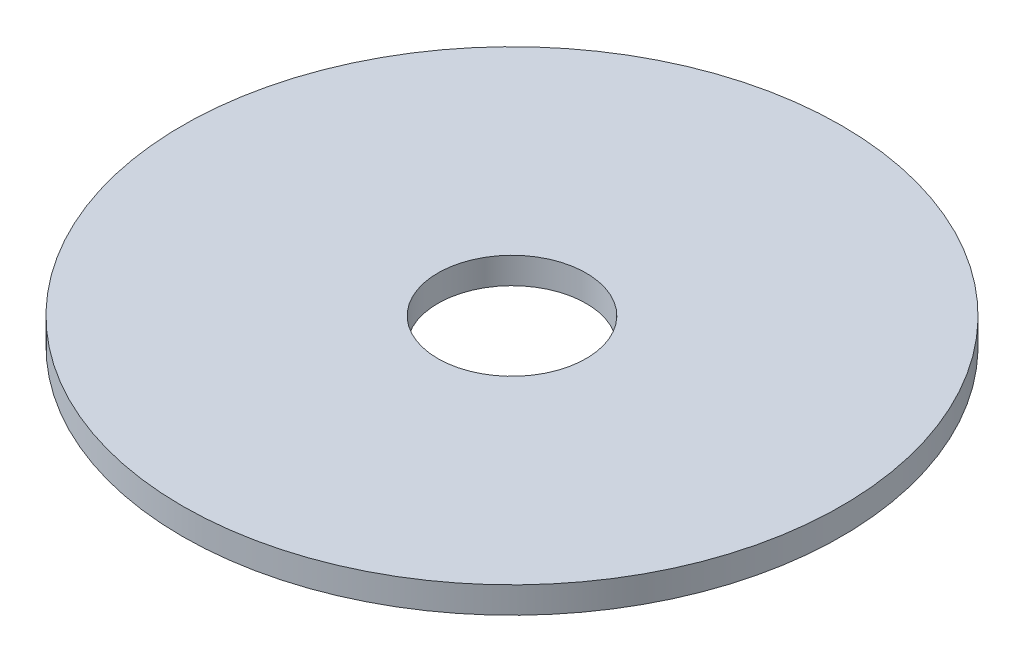
ISO-10303-21;
HEADER;
FILE_DESCRIPTION(('STEP AP214'),'2;1');
FILE_NAME('part.step','',(''),(''),'','','');
FILE_SCHEMA(('AUTOMOTIVE_DESIGN { 1 0 10303 214 1 1 1 1 }'));
ENDSEC;
DATA;
#1=APPLICATION_CONTEXT('core data for automotive mechanical design processes');
#2=APPLICATION_PROTOCOL_DEFINITION('international standard','automotive_design',2000,#1);
#3=PRODUCT_CONTEXT('',#1,'mechanical');
#4=PRODUCT('Part','Part','',(#3));
#5=PRODUCT_RELATED_PRODUCT_CATEGORY('part','',(#4));
#6=PRODUCT_DEFINITION_FORMATION('','',#4);
#7=PRODUCT_DEFINITION_CONTEXT('part definition',#1,'design');
#8=PRODUCT_DEFINITION('design','',#6,#7);
#9=PRODUCT_DEFINITION_SHAPE('','',#8);
#10=(LENGTH_UNIT() NAMED_UNIT(*) SI_UNIT(.MILLI.,.METRE.));
#11=(NAMED_UNIT(*) PLANE_ANGLE_UNIT() SI_UNIT($,.RADIAN.));
#12=(NAMED_UNIT(*) SI_UNIT($,.STERADIAN.) SOLID_ANGLE_UNIT());
#13=UNCERTAINTY_MEASURE_WITH_UNIT(LENGTH_MEASURE(1.E-05),#10,'distance_accuracy_value','');
#14=(GEOMETRIC_REPRESENTATION_CONTEXT(3) GLOBAL_UNCERTAINTY_ASSIGNED_CONTEXT((#13)) GLOBAL_UNIT_ASSIGNED_CONTEXT((#10,
#11,#12)) REPRESENTATION_CONTEXT('',''));
#15=CARTESIAN_POINT('',(0.,0.,0.));
#16=DIRECTION('',(0.,0.,1.));
#17=DIRECTION('',(1.,0.,0.));
#18=AXIS2_PLACEMENT_3D('',#15,#16,#17);
#19=CARTESIAN_POINT('',(0.,8.,0.));
#20=DIRECTION('',(0.,-1.,0.));
#21=DIRECTION('',(0.,0.,-1.));
#22=AXIS2_PLACEMENT_3D('',#19,#20,#21);
#23=CYLINDRICAL_SURFACE('',#22,100.);
#24=CARTESIAN_POINT('',(0.,8.,0.));
#25=DIRECTION('',(0.,1.,0.));
#26=DIRECTION('',(0.,0.,1.));
#27=AXIS2_PLACEMENT_3D('',#24,#25,#26);
#28=CIRCLE('',#27,100.);
#29=CARTESIAN_POINT('',(0.,8.,100.));
#30=VERTEX_POINT('',#29);
#31=EDGE_CURVE('E10',#30,#30,#28,.T.);
#32=ORIENTED_EDGE('',*,*,#31,.F.);
#33=EDGE_LOOP('',(#32));
#34=FACE_BOUND('',#33,.T.);
#35=CARTESIAN_POINT('',(0.,0.,0.));
#36=DIRECTION('',(0.,1.,0.));
#37=DIRECTION('',(0.,0.,1.));
#38=AXIS2_PLACEMENT_3D('',#35,#36,#37);
#39=CIRCLE('',#38,100.);
#40=CARTESIAN_POINT('',(0.,0.,100.));
#41=VERTEX_POINT('',#40);
#42=EDGE_CURVE('E37',#41,#41,#39,.T.);
#43=ORIENTED_EDGE('',*,*,#42,.T.);
#44=EDGE_LOOP('',(#43));
#45=FACE_BOUND('',#44,.T.);
#46=ADVANCED_FACE('F40',(#34,#45),#23,.T.);
#47=CARTESIAN_POINT('',(0.,8.,0.));
#48=DIRECTION('',(0.,1.,0.));
#49=DIRECTION('',(0.,0.,1.));
#50=AXIS2_PLACEMENT_3D('',#47,#48,#49);
#51=PLANE('',#50);
#52=CARTESIAN_POINT('',(0.,8.,0.));
#53=DIRECTION('',(0.,1.,0.));
#54=DIRECTION('',(0.,0.,1.));
#55=AXIS2_PLACEMENT_3D('',#52,#53,#54);
#56=CIRCLE('',#55,22.5);
#57=CARTESIAN_POINT('',(0.,8.,22.5));
#58=VERTEX_POINT('',#57);
#59=EDGE_CURVE('E50',#58,#58,#56,.T.);
#60=ORIENTED_EDGE('',*,*,#59,.F.);
#61=EDGE_LOOP('',(#60));
#62=FACE_BOUND('',#61,.T.);
#63=ORIENTED_EDGE('',*,*,#31,.T.);
#64=EDGE_LOOP('',(#63));
#65=FACE_BOUND('',#64,.T.);
#66=ADVANCED_FACE('F59',(#62,#65),#51,.T.);
#67=CARTESIAN_POINT('',(0.,0.,0.));
#68=DIRECTION('',(0.,1.,0.));
#69=DIRECTION('',(0.,0.,1.));
#70=AXIS2_PLACEMENT_3D('',#67,#68,#69);
#71=PLANE('',#70);
#72=CARTESIAN_POINT('',(0.,0.,0.));
#73=DIRECTION('',(0.,1.,0.));
#74=DIRECTION('',(0.,0.,1.));
#75=AXIS2_PLACEMENT_3D('',#72,#73,#74);
#76=CIRCLE('',#75,22.5);
#77=CARTESIAN_POINT('',(0.,0.,22.5));
#78=VERTEX_POINT('',#77);
#79=EDGE_CURVE('E47',#78,#78,#76,.T.);
#80=ORIENTED_EDGE('',*,*,#79,.T.);
#81=EDGE_LOOP('',(#80));
#82=FACE_BOUND('',#81,.T.);
#83=ORIENTED_EDGE('',*,*,#42,.F.);
#84=EDGE_LOOP('',(#83));
#85=FACE_BOUND('',#84,.T.);
#86=ADVANCED_FACE('F58',(#82,#85),#71,.F.);
#87=CARTESIAN_POINT('',(0.,8.,0.));
#88=DIRECTION('',(0.,-1.,0.));
#89=DIRECTION('',(0.,0.,-1.));
#90=AXIS2_PLACEMENT_3D('',#87,#88,#89);
#91=CYLINDRICAL_SURFACE('',#90,22.5);
#92=ORIENTED_EDGE('',*,*,#59,.T.);
#93=EDGE_LOOP('',(#92));
#94=FACE_BOUND('',#93,.T.);
#95=ORIENTED_EDGE('',*,*,#79,.F.);
#96=EDGE_LOOP('',(#95));
#97=FACE_BOUND('',#96,.T.);
#98=ADVANCED_FACE('F54',(#94,#97),#91,.F.);
#99=CLOSED_SHELL('',(#46,#66,#86,#98));
#100=MANIFOLD_SOLID_BREP('B2',#99);
#101=ADVANCED_BREP_SHAPE_REPRESENTATION('',(#18,#100),#14);
#102=SHAPE_DEFINITION_REPRESENTATION(#9,#101);
ENDSEC;
END-ISO-10303-21;
